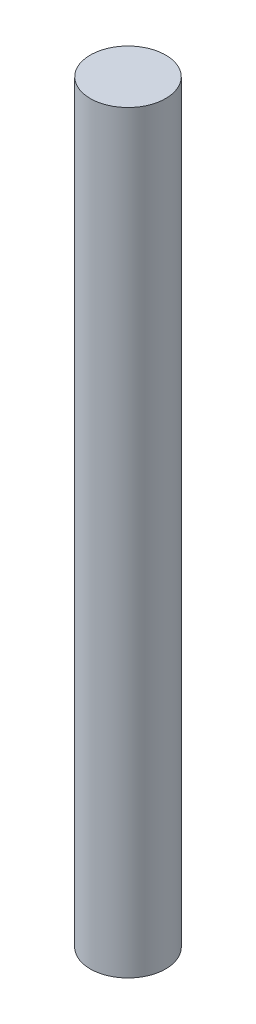
ISO-10303-21;
HEADER;
FILE_DESCRIPTION(('STEP AP214'),'2;1');
FILE_NAME('part.step','',(''),(''),'','','');
FILE_SCHEMA(('AUTOMOTIVE_DESIGN { 1 0 10303 214 1 1 1 1 }'));
ENDSEC;
DATA;
#1=APPLICATION_CONTEXT('core data for automotive mechanical design processes');
#2=APPLICATION_PROTOCOL_DEFINITION('international standard','automotive_design',2000,#1);
#3=PRODUCT_CONTEXT('',#1,'mechanical');
#4=PRODUCT('Part','Part','',(#3));
#5=PRODUCT_RELATED_PRODUCT_CATEGORY('part','',(#4));
#6=PRODUCT_DEFINITION_FORMATION('','',#4);
#7=PRODUCT_DEFINITION_CONTEXT('part definition',#1,'design');
#8=PRODUCT_DEFINITION('design','',#6,#7);
#9=PRODUCT_DEFINITION_SHAPE('','',#8);
#10=(LENGTH_UNIT() NAMED_UNIT(*) SI_UNIT(.MILLI.,.METRE.));
#11=(NAMED_UNIT(*) PLANE_ANGLE_UNIT() SI_UNIT($,.RADIAN.));
#12=(NAMED_UNIT(*) SI_UNIT($,.STERADIAN.) SOLID_ANGLE_UNIT());
#13=UNCERTAINTY_MEASURE_WITH_UNIT(LENGTH_MEASURE(1.E-05),#10,'distance_accuracy_value','');
#14=(GEOMETRIC_REPRESENTATION_CONTEXT(3) GLOBAL_UNCERTAINTY_ASSIGNED_CONTEXT((#13)) GLOBAL_UNIT_ASSIGNED_CONTEXT((#10,
#11,#12)) REPRESENTATION_CONTEXT('',''));
#15=CARTESIAN_POINT('',(0.,0.,0.));
#16=DIRECTION('',(0.,0.,1.));
#17=DIRECTION('',(1.,0.,0.));
#18=AXIS2_PLACEMENT_3D('',#15,#16,#17);
#19=CARTESIAN_POINT('',(0.,50.,0.));
#20=DIRECTION('',(0.,-1.,0.));
#21=DIRECTION('',(0.,0.,-1.));
#22=AXIS2_PLACEMENT_3D('',#19,#20,#21);
#23=CYLINDRICAL_SURFACE('',#22,2.5);
#24=CARTESIAN_POINT('',(0.,50.,0.));
#25=DIRECTION('',(0.,1.,0.));
#26=DIRECTION('',(0.,0.,1.));
#27=AXIS2_PLACEMENT_3D('',#24,#25,#26);
#28=CIRCLE('',#27,2.5);
#29=CARTESIAN_POINT('',(0.,50.,2.5));
#30=VERTEX_POINT('',#29);
#31=EDGE_CURVE('E10',#30,#30,#28,.T.);
#32=ORIENTED_EDGE('',*,*,#31,.F.);
#33=EDGE_LOOP('',(#32));
#34=FACE_BOUND('',#33,.T.);
#35=CARTESIAN_POINT('',(0.,0.,0.));
#36=DIRECTION('',(0.,1.,0.));
#37=DIRECTION('',(0.,0.,1.));
#38=AXIS2_PLACEMENT_3D('',#35,#36,#37);
#39=CIRCLE('',#38,2.5);
#40=CARTESIAN_POINT('',(0.,0.,2.5));
#41=VERTEX_POINT('',#40);
#42=EDGE_CURVE('E40',#41,#41,#39,.T.);
#43=ORIENTED_EDGE('',*,*,#42,.T.);
#44=EDGE_LOOP('',(#43));
#45=FACE_BOUND('',#44,.T.);
#46=ADVANCED_FACE('F37',(#34,#45),#23,.T.);
#47=CARTESIAN_POINT('',(0.,50.,0.));
#48=DIRECTION('',(0.,1.,0.));
#49=DIRECTION('',(0.,0.,1.));
#50=AXIS2_PLACEMENT_3D('',#47,#48,#49);
#51=PLANE('',#50);
#52=ORIENTED_EDGE('',*,*,#31,.T.);
#53=EDGE_LOOP('',(#52));
#54=FACE_BOUND('',#53,.T.);
#55=ADVANCED_FACE('F54',(#54),#51,.T.);
#56=CARTESIAN_POINT('',(0.,0.,0.));
#57=DIRECTION('',(0.,1.,0.));
#58=DIRECTION('',(0.,0.,1.));
#59=AXIS2_PLACEMENT_3D('',#56,#57,#58);
#60=PLANE('',#59);
#61=ORIENTED_EDGE('',*,*,#42,.F.);
#62=EDGE_LOOP('',(#61));
#63=FACE_BOUND('',#62,.T.);
#64=ADVANCED_FACE('F52',(#63),#60,.F.);
#65=CLOSED_SHELL('',(#46,#55,#64));
#66=MANIFOLD_SOLID_BREP('B2',#65);
#67=ADVANCED_BREP_SHAPE_REPRESENTATION('',(#18,#66),#14);
#68=SHAPE_DEFINITION_REPRESENTATION(#9,#67);
ENDSEC;
END-ISO-10303-21;
